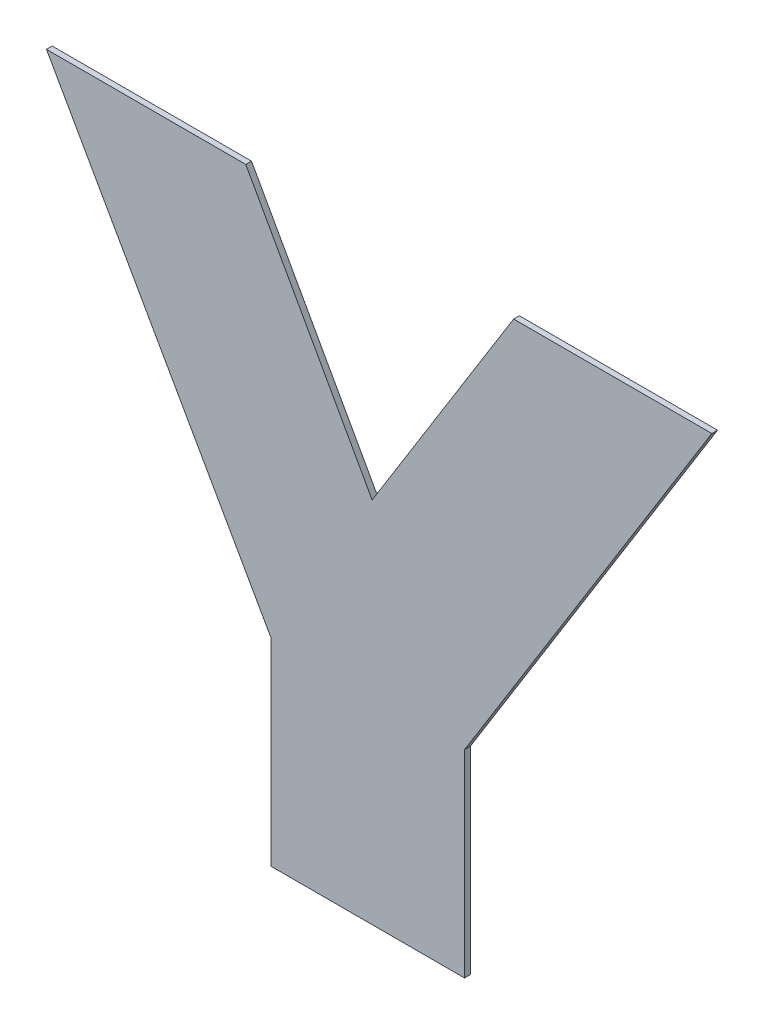
ISO-10303-21;
HEADER;
FILE_DESCRIPTION(('STEP AP214'),'2;1');
FILE_NAME('part.step','',(''),(''),'','','');
FILE_SCHEMA(('AUTOMOTIVE_DESIGN { 1 0 10303 214 1 1 1 1 }'));
ENDSEC;
DATA;
#1=APPLICATION_CONTEXT('core data for automotive mechanical design processes');
#2=APPLICATION_PROTOCOL_DEFINITION('international standard','automotive_design',2000,#1);
#3=PRODUCT_CONTEXT('',#1,'mechanical');
#4=PRODUCT('Part','Part','',(#3));
#5=PRODUCT_RELATED_PRODUCT_CATEGORY('part','',(#4));
#6=PRODUCT_DEFINITION_FORMATION('','',#4);
#7=PRODUCT_DEFINITION_CONTEXT('part definition',#1,'design');
#8=PRODUCT_DEFINITION('design','',#6,#7);
#9=PRODUCT_DEFINITION_SHAPE('','',#8);
#10=(LENGTH_UNIT() NAMED_UNIT(*) SI_UNIT(.MILLI.,.METRE.));
#11=(NAMED_UNIT(*) PLANE_ANGLE_UNIT() SI_UNIT($,.RADIAN.));
#12=(NAMED_UNIT(*) SI_UNIT($,.STERADIAN.) SOLID_ANGLE_UNIT());
#13=UNCERTAINTY_MEASURE_WITH_UNIT(LENGTH_MEASURE(1.E-05),#10,'distance_accuracy_value','');
#14=(GEOMETRIC_REPRESENTATION_CONTEXT(3) GLOBAL_UNCERTAINTY_ASSIGNED_CONTEXT((#13)) GLOBAL_UNIT_ASSIGNED_CONTEXT((#10,
#11,#12)) REPRESENTATION_CONTEXT('',''));
#15=CARTESIAN_POINT('',(0.,0.,0.));
#16=DIRECTION('',(0.,0.,1.));
#17=DIRECTION('',(1.,0.,0.));
#18=AXIS2_PLACEMENT_3D('',#15,#16,#17);
#19=CARTESIAN_POINT('',(1.19780653669011,0.676878993436684,0.551));
#20=DIRECTION('',(-0.870607075952532,-0.491978982580946,0.));
#21=DIRECTION('',(0.491978982580946,-0.870607075952532,0.));
#22=AXIS2_PLACEMENT_3D('',#19,#20,#21);
#23=PLANE('',#22);
#24=DIRECTION('',(-0.491978982580944,0.870607075952533,0.));
#25=VECTOR('',#24,1.);
#26=CARTESIAN_POINT('',(0.97372563405429,1.07341304535317,0.55));
#27=LINE('',#26,#25);
#28=CARTESIAN_POINT('',(0.97372563405429,1.07341304535317,0.55));
#29=VERTEX_POINT('',#28);
#30=CARTESIAN_POINT('',(0.934459399837902,1.1428986586927,0.55));
#31=VERTEX_POINT('',#30);
#32=EDGE_CURVE('E11',#29,#31,#27,.T.);
#33=ORIENTED_EDGE('',*,*,#32,.F.);
#34=DIRECTION('',(-1.11022302462503E-13,0.,-1.));
#35=VECTOR('',#34,1.);
#36=CARTESIAN_POINT('',(0.97372563405429,1.07341304535317,0.551));
#37=LINE('',#36,#35);
#38=CARTESIAN_POINT('',(0.97372563405429,1.07341304535317,0.551));
#39=VERTEX_POINT('',#38);
#40=EDGE_CURVE('E164',#39,#29,#37,.T.);
#41=ORIENTED_EDGE('',*,*,#40,.F.);
#42=DIRECTION('',(-0.491978982580944,0.870607075952533,0.));
#43=VECTOR('',#42,1.);
#44=CARTESIAN_POINT('',(0.97372563405429,1.07341304535317,0.551));
#45=LINE('',#44,#43);
#46=CARTESIAN_POINT('',(0.934459399837902,1.1428986586927,0.551));
#47=VERTEX_POINT('',#46);
#48=EDGE_CURVE('E157',#39,#47,#45,.T.);
#49=ORIENTED_EDGE('',*,*,#48,.T.);
#50=DIRECTION('',(0.,-2.22044604925006E-13,-1.));
#51=VECTOR('',#50,1.);
#52=CARTESIAN_POINT('',(0.934459399837902,1.1428986586927,0.551));
#53=LINE('',#52,#51);
#54=EDGE_CURVE('E103',#47,#31,#53,.T.);
#55=ORIENTED_EDGE('',*,*,#54,.T.);
#56=EDGE_LOOP('',(#33,#41,#49,#55));
#57=FACE_BOUND('',#56,.T.);
#58=ADVANCED_FACE('F17',(#57),#23,.T.);
#59=CARTESIAN_POINT('',(0.97372563405429,0.,0.551));
#60=DIRECTION('',(-1.,0.,0.));
#61=DIRECTION('',(0.,0.,1.));
#62=AXIS2_PLACEMENT_3D('',#59,#60,#61);
#63=PLANE('',#62);
#64=DIRECTION('',(0.,1.,0.));
#65=VECTOR('',#64,1.);
#66=CARTESIAN_POINT('',(0.97372563405429,1.03884313801927,0.55));
#67=LINE('',#66,#65);
#68=CARTESIAN_POINT('',(0.97372563405429,1.03884313801927,0.55));
#69=VERTEX_POINT('',#68);
#70=EDGE_CURVE('E24',#69,#29,#67,.T.);
#71=ORIENTED_EDGE('',*,*,#70,.F.);
#72=DIRECTION('',(-1.11022302462503E-13,0.,-1.));
#73=VECTOR('',#72,1.);
#74=CARTESIAN_POINT('',(0.97372563405429,1.03884313801927,0.551));
#75=LINE('',#74,#73);
#76=CARTESIAN_POINT('',(0.97372563405429,1.03884313801927,0.551));
#77=VERTEX_POINT('',#76);
#78=EDGE_CURVE('E159',#77,#69,#75,.T.);
#79=ORIENTED_EDGE('',*,*,#78,.F.);
#80=DIRECTION('',(0.,1.,0.));
#81=VECTOR('',#80,1.);
#82=CARTESIAN_POINT('',(0.97372563405429,1.03884313801927,0.551));
#83=LINE('',#82,#81);
#84=EDGE_CURVE('E148',#77,#39,#83,.T.);
#85=ORIENTED_EDGE('',*,*,#84,.T.);
#86=ORIENTED_EDGE('',*,*,#40,.T.);
#87=EDGE_LOOP('',(#71,#79,#85,#86));
#88=FACE_BOUND('',#87,.T.);
#89=ADVANCED_FACE('F175',(#88),#63,.T.);
#90=CARTESIAN_POINT('',(0.,1.03884313801927,0.551));
#91=DIRECTION('',(0.,-1.,0.));
#92=DIRECTION('',(0.,0.,-1.));
#93=AXIS2_PLACEMENT_3D('',#90,#91,#92);
#94=PLANE('',#93);
#95=DIRECTION('',(-1.,0.,0.));
#96=VECTOR('',#95,1.);
#97=CARTESIAN_POINT('',(1.00755012595935,1.03884313801927,0.55));
#98=LINE('',#97,#96);
#99=CARTESIAN_POINT('',(1.00755012595935,1.03884313801927,0.55));
#100=VERTEX_POINT('',#99);
#101=EDGE_CURVE('E161',#100,#69,#98,.T.);
#102=ORIENTED_EDGE('',*,*,#101,.F.);
#103=DIRECTION('',(0.,0.,-1.));
#104=VECTOR('',#103,1.);
#105=CARTESIAN_POINT('',(1.00755012595935,1.03884313801927,0.551));
#106=LINE('',#105,#104);
#107=CARTESIAN_POINT('',(1.00755012595935,1.03884313801927,0.551));
#108=VERTEX_POINT('',#107);
#109=EDGE_CURVE('E151',#108,#100,#106,.T.);
#110=ORIENTED_EDGE('',*,*,#109,.F.);
#111=DIRECTION('',(-1.,0.,0.));
#112=VECTOR('',#111,1.);
#113=CARTESIAN_POINT('',(1.00755012595935,1.03884313801927,0.551));
#114=LINE('',#113,#112);
#115=EDGE_CURVE('E138',#108,#77,#114,.T.);
#116=ORIENTED_EDGE('',*,*,#115,.T.);
#117=ORIENTED_EDGE('',*,*,#78,.T.);
#118=EDGE_LOOP('',(#102,#110,#116,#117));
#119=FACE_BOUND('',#118,.T.);
#120=ADVANCED_FACE('F168',(#119),#94,.T.);
#121=CARTESIAN_POINT('',(1.00755012595933,0.,0.551));
#122=DIRECTION('',(1.,0.,0.));
#123=DIRECTION('',(0.,1.,0.));
#124=AXIS2_PLACEMENT_3D('',#121,#122,#123);
#125=PLANE('',#124);
#126=DIRECTION('',(0.,-1.,0.));
#127=VECTOR('',#126,1.);
#128=CARTESIAN_POINT('',(1.00755012595935,1.07341304535317,0.55));
#129=LINE('',#128,#127);
#130=CARTESIAN_POINT('',(1.00755012595935,1.07341304535317,0.55));
#131=VERTEX_POINT('',#130);
#132=EDGE_CURVE('E154',#131,#100,#129,.T.);
#133=ORIENTED_EDGE('',*,*,#132,.F.);
#134=DIRECTION('',(0.,0.,-1.));
#135=VECTOR('',#134,1.);
#136=CARTESIAN_POINT('',(1.00755012595935,1.07341304535317,0.551));
#137=LINE('',#136,#135);
#138=CARTESIAN_POINT('',(1.00755012595935,1.07341304535317,0.551));
#139=VERTEX_POINT('',#138);
#140=EDGE_CURVE('E141',#139,#131,#137,.T.);
#141=ORIENTED_EDGE('',*,*,#140,.F.);
#142=DIRECTION('',(0.,-1.,0.));
#143=VECTOR('',#142,1.);
#144=CARTESIAN_POINT('',(1.00755012595935,1.07341304535317,0.551));
#145=LINE('',#144,#143);
#146=EDGE_CURVE('E129',#139,#108,#145,.T.);
#147=ORIENTED_EDGE('',*,*,#146,.T.);
#148=ORIENTED_EDGE('',*,*,#109,.T.);
#149=EDGE_LOOP('',(#133,#141,#147,#148));
#150=FACE_BOUND('',#149,.T.);
#151=ADVANCED_FACE('F170',(#150),#125,.T.);
#152=CARTESIAN_POINT('',(0.244851750773486,-0.152352200481278,0.551));
#153=DIRECTION('',(0.849056603773588,-0.528301886792447,0.));
#154=DIRECTION('',(0.528301886792447,0.849056603773588,0.));
#155=AXIS2_PLACEMENT_3D('',#152,#153,#154);
#156=PLANE('',#155);
#157=DIRECTION('',(-0.528301886792449,-0.849056603773587,0.));
#158=VECTOR('',#157,1.);
#159=CARTESIAN_POINT('',(1.05078561870395,1.1428986586927,0.55));
#160=LINE('',#159,#158);
#161=CARTESIAN_POINT('',(1.05078561870395,1.1428986586927,0.55));
#162=VERTEX_POINT('',#161);
#163=EDGE_CURVE('E144',#162,#131,#160,.T.);
#164=ORIENTED_EDGE('',*,*,#163,.F.);
#165=DIRECTION('',(0.,-2.22044604925006E-13,-1.));
#166=VECTOR('',#165,1.);
#167=CARTESIAN_POINT('',(1.05078561870395,1.1428986586927,0.551));
#168=LINE('',#167,#166);
#169=CARTESIAN_POINT('',(1.05078561870395,1.1428986586927,0.551));
#170=VERTEX_POINT('',#169);
#171=EDGE_CURVE('E132',#170,#162,#168,.T.);
#172=ORIENTED_EDGE('',*,*,#171,.F.);
#173=DIRECTION('',(-0.528301886792449,-0.849056603773587,0.));
#174=VECTOR('',#173,1.);
#175=CARTESIAN_POINT('',(1.05078561870395,1.1428986586927,0.551));
#176=LINE('',#175,#174);
#177=EDGE_CURVE('E120',#170,#139,#176,.T.);
#178=ORIENTED_EDGE('',*,*,#177,.T.);
#179=ORIENTED_EDGE('',*,*,#140,.T.);
#180=EDGE_LOOP('',(#164,#172,#178,#179));
#181=FACE_BOUND('',#180,.T.);
#182=ADVANCED_FACE('F181',(#181),#156,.T.);
#183=CARTESIAN_POINT('',(0.,1.1428986586927,0.551));
#184=DIRECTION('',(0.,1.,0.));
#185=DIRECTION('',(0.,0.,1.));
#186=AXIS2_PLACEMENT_3D('',#183,#184,#185);
#187=PLANE('',#186);
#188=DIRECTION('',(1.,0.,0.));
#189=VECTOR('',#188,1.);
#190=CARTESIAN_POINT('',(1.01613316700799,1.1428986586927,0.55));
#191=LINE('',#190,#189);
#192=CARTESIAN_POINT('',(1.01613316700799,1.1428986586927,0.55));
#193=VERTEX_POINT('',#192);
#194=EDGE_CURVE('E135',#193,#162,#191,.T.);
#195=ORIENTED_EDGE('',*,*,#194,.F.);
#196=DIRECTION('',(0.,-2.22044604925006E-13,-1.));
#197=VECTOR('',#196,1.);
#198=CARTESIAN_POINT('',(1.01613316700799,1.1428986586927,0.551));
#199=LINE('',#198,#197);
#200=CARTESIAN_POINT('',(1.01613316700799,1.1428986586927,0.551));
#201=VERTEX_POINT('',#200);
#202=EDGE_CURVE('E123',#201,#193,#199,.T.);
#203=ORIENTED_EDGE('',*,*,#202,.F.);
#204=DIRECTION('',(1.,0.,0.));
#205=VECTOR('',#204,1.);
#206=CARTESIAN_POINT('',(1.01613316700799,1.1428986586927,0.551));
#207=LINE('',#206,#205);
#208=EDGE_CURVE('E114',#201,#170,#207,.T.);
#209=ORIENTED_EDGE('',*,*,#208,.T.);
#210=ORIENTED_EDGE('',*,*,#171,.T.);
#211=EDGE_LOOP('',(#195,#203,#209,#210));
#212=FACE_BOUND('',#211,.T.);
#213=ADVANCED_FACE('F179',(#212),#187,.T.);
#214=CARTESIAN_POINT('',(0.219870898269276,-0.136808558923103,0.551));
#215=DIRECTION('',(-0.849056603773588,0.528301886792448,0.));
#216=DIRECTION('',(-0.528301886792448,-0.849056603773588,0.));
#217=AXIS2_PLACEMENT_3D('',#214,#215,#216);
#218=PLANE('',#217);
#219=DIRECTION('',(0.528301886792446,0.849056603773589,0.));
#220=VECTOR('',#219,1.);
#221=CARTESIAN_POINT('',(0.991395439451665,1.10314159654861,0.55));
#222=LINE('',#221,#220);
#223=CARTESIAN_POINT('',(0.991395439451665,1.10314159654861,0.55));
#224=VERTEX_POINT('',#223);
#225=EDGE_CURVE('E126',#224,#193,#222,.T.);
#226=ORIENTED_EDGE('',*,*,#225,.F.);
#227=DIRECTION('',(-1.11022302462503E-13,0.,-1.));
#228=VECTOR('',#227,1.);
#229=CARTESIAN_POINT('',(0.991395439451665,1.10314159654861,0.551));
#230=LINE('',#229,#228);
#231=CARTESIAN_POINT('',(0.991395439451665,1.10314159654861,0.551));
#232=VERTEX_POINT('',#231);
#233=EDGE_CURVE('E117',#232,#224,#230,.T.);
#234=ORIENTED_EDGE('',*,*,#233,.F.);
#235=DIRECTION('',(0.528301886792446,0.849056603773589,0.));
#236=VECTOR('',#235,1.);
#237=CARTESIAN_POINT('',(0.991395439451665,1.10314159654861,0.551));
#238=LINE('',#237,#236);
#239=EDGE_CURVE('E97',#232,#201,#238,.T.);
#240=ORIENTED_EDGE('',*,*,#239,.T.);
#241=ORIENTED_EDGE('',*,*,#202,.T.);
#242=EDGE_LOOP('',(#226,#234,#240,#241));
#243=FACE_BOUND('',#242,.T.);
#244=ADVANCED_FACE('F177',(#243),#218,.T.);
#245=CARTESIAN_POINT('',(1.22589058905917,0.681050327255132,0.551));
#246=DIRECTION('',(0.874157276121526,0.485642931178653,0.));
#247=DIRECTION('',(-0.485642931178653,0.874157276121526,0.));
#248=AXIS2_PLACEMENT_3D('',#245,#246,#247);
#249=PLANE('',#248);
#250=DIRECTION('',(0.48564293117865,-0.874157276121528,0.));
#251=VECTOR('',#250,1.);
#252=CARTESIAN_POINT('',(0.969308182704945,1.1428986586927,0.55));
#253=LINE('',#252,#251);
#254=CARTESIAN_POINT('',(0.969308182704946,1.1428986586927,0.55));
#255=VERTEX_POINT('',#254);
#256=EDGE_CURVE('E92',#255,#224,#253,.T.);
#257=ORIENTED_EDGE('',*,*,#256,.F.);
#258=DIRECTION('',(0.,-2.22044604925006E-13,-1.));
#259=VECTOR('',#258,1.);
#260=CARTESIAN_POINT('',(0.969308182704946,1.1428986586927,0.551));
#261=LINE('',#260,#259);
#262=CARTESIAN_POINT('',(0.969308182704946,1.1428986586927,0.551));
#263=VERTEX_POINT('',#262);
#264=EDGE_CURVE('E84',#263,#255,#261,.T.);
#265=ORIENTED_EDGE('',*,*,#264,.F.);
#266=DIRECTION('',(0.48564293117865,-0.874157276121528,0.));
#267=VECTOR('',#266,1.);
#268=CARTESIAN_POINT('',(0.969308182704945,1.1428986586927,0.551));
#269=LINE('',#268,#267);
#270=EDGE_CURVE('E89',#263,#232,#269,.T.);
#271=ORIENTED_EDGE('',*,*,#270,.T.);
#272=ORIENTED_EDGE('',*,*,#233,.T.);
#273=EDGE_LOOP('',(#257,#265,#271,#272));
#274=FACE_BOUND('',#273,.T.);
#275=ADVANCED_FACE('F86',(#274),#249,.T.);
#276=CARTESIAN_POINT('',(0.,1.1428986586927,0.551));
#277=DIRECTION('',(0.,1.,0.));
#278=DIRECTION('',(0.,0.,1.));
#279=AXIS2_PLACEMENT_3D('',#276,#277,#278);
#280=PLANE('',#279);
#281=DIRECTION('',(1.,0.,0.));
#282=VECTOR('',#281,1.);
#283=CARTESIAN_POINT('',(0.934459399837902,1.1428986586927,0.55));
#284=LINE('',#283,#282);
#285=EDGE_CURVE('E96',#31,#255,#284,.T.);
#286=ORIENTED_EDGE('',*,*,#285,.F.);
#287=ORIENTED_EDGE('',*,*,#54,.F.);
#288=DIRECTION('',(1.,0.,0.));
#289=VECTOR('',#288,1.);
#290=CARTESIAN_POINT('',(0.934459399837902,1.1428986586927,0.551));
#291=LINE('',#290,#289);
#292=EDGE_CURVE('E101',#47,#263,#291,.T.);
#293=ORIENTED_EDGE('',*,*,#292,.T.);
#294=ORIENTED_EDGE('',*,*,#264,.T.);
#295=EDGE_LOOP('',(#286,#287,#293,#294));
#296=FACE_BOUND('',#295,.T.);
#297=ADVANCED_FACE('F102',(#296),#280,.T.);
#298=CARTESIAN_POINT('',(0.,0.,0.551));
#299=DIRECTION('',(0.,0.,1.));
#300=DIRECTION('',(1.,0.,0.));
#301=AXIS2_PLACEMENT_3D('',#298,#299,#300);
#302=PLANE('',#301);
#303=ORIENTED_EDGE('',*,*,#48,.F.);
#304=ORIENTED_EDGE('',*,*,#84,.F.);
#305=ORIENTED_EDGE('',*,*,#115,.F.);
#306=ORIENTED_EDGE('',*,*,#146,.F.);
#307=ORIENTED_EDGE('',*,*,#177,.F.);
#308=ORIENTED_EDGE('',*,*,#208,.F.);
#309=ORIENTED_EDGE('',*,*,#239,.F.);
#310=ORIENTED_EDGE('',*,*,#270,.F.);
#311=ORIENTED_EDGE('',*,*,#292,.F.);
#312=EDGE_LOOP('',(#303,#304,#305,#306,#307,#308,#309,#310,#311));
#313=FACE_BOUND('',#312,.T.);
#314=ADVANCED_FACE('F107',(#313),#302,.T.);
#315=CARTESIAN_POINT('',(0.,0.,0.55));
#316=DIRECTION('',(0.,0.,1.));
#317=DIRECTION('',(1.,0.,0.));
#318=AXIS2_PLACEMENT_3D('',#315,#316,#317);
#319=PLANE('',#318);
#320=ORIENTED_EDGE('',*,*,#32,.T.);
#321=ORIENTED_EDGE('',*,*,#285,.T.);
#322=ORIENTED_EDGE('',*,*,#256,.T.);
#323=ORIENTED_EDGE('',*,*,#225,.T.);
#324=ORIENTED_EDGE('',*,*,#194,.T.);
#325=ORIENTED_EDGE('',*,*,#163,.T.);
#326=ORIENTED_EDGE('',*,*,#132,.T.);
#327=ORIENTED_EDGE('',*,*,#101,.T.);
#328=ORIENTED_EDGE('',*,*,#70,.T.);
#329=EDGE_LOOP('',(#320,#321,#322,#323,#324,#325,#326,#327,#328));
#330=FACE_BOUND('',#329,.T.);
#331=ADVANCED_FACE('F166',(#330),#319,.F.);
#332=CLOSED_SHELL('',(#58,#89,#120,#151,#182,#213,#244,#275,#297,#314,#331));
#333=MANIFOLD_SOLID_BREP('B1',#332);
#334=ADVANCED_BREP_SHAPE_REPRESENTATION('',(#18,#333),#14);
#335=SHAPE_DEFINITION_REPRESENTATION(#9,#334);
ENDSEC;
END-ISO-10303-21;
